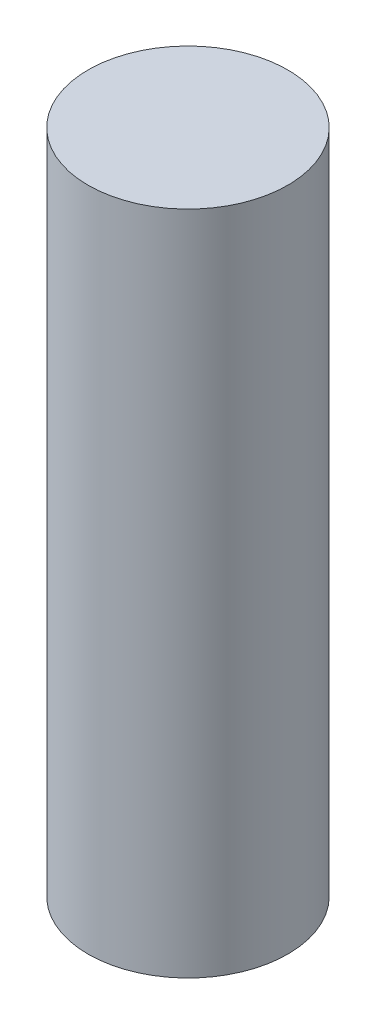
ISO-10303-21;
HEADER;
FILE_DESCRIPTION(('STEP AP214'),'2;1');
FILE_NAME('part.step','',(''),(''),'','','');
FILE_SCHEMA(('AUTOMOTIVE_DESIGN { 1 0 10303 214 1 1 1 1 }'));
ENDSEC;
DATA;
#1=APPLICATION_CONTEXT('core data for automotive mechanical design processes');
#2=APPLICATION_PROTOCOL_DEFINITION('international standard','automotive_design',2000,#1);
#3=PRODUCT_CONTEXT('',#1,'mechanical');
#4=PRODUCT('Part','Part','',(#3));
#5=PRODUCT_RELATED_PRODUCT_CATEGORY('part','',(#4));
#6=PRODUCT_DEFINITION_FORMATION('','',#4);
#7=PRODUCT_DEFINITION_CONTEXT('part definition',#1,'design');
#8=PRODUCT_DEFINITION('design','',#6,#7);
#9=PRODUCT_DEFINITION_SHAPE('','',#8);
#10=(LENGTH_UNIT() NAMED_UNIT(*) SI_UNIT(.MILLI.,.METRE.));
#11=(NAMED_UNIT(*) PLANE_ANGLE_UNIT() SI_UNIT($,.RADIAN.));
#12=(NAMED_UNIT(*) SI_UNIT($,.STERADIAN.) SOLID_ANGLE_UNIT());
#13=UNCERTAINTY_MEASURE_WITH_UNIT(LENGTH_MEASURE(1.E-05),#10,'distance_accuracy_value','');
#14=(GEOMETRIC_REPRESENTATION_CONTEXT(3) GLOBAL_UNCERTAINTY_ASSIGNED_CONTEXT((#13)) GLOBAL_UNIT_ASSIGNED_CONTEXT((#10,
#11,#12)) REPRESENTATION_CONTEXT('',''));
#15=CARTESIAN_POINT('',(0.,0.,0.));
#16=DIRECTION('',(0.,0.,1.));
#17=DIRECTION('',(1.,0.,0.));
#18=AXIS2_PLACEMENT_3D('',#15,#16,#17);
#19=CARTESIAN_POINT('',(0.,300.,0.));
#20=DIRECTION('',(0.,-1.,0.));
#21=DIRECTION('',(0.,0.,-1.));
#22=AXIS2_PLACEMENT_3D('',#19,#20,#21);
#23=CYLINDRICAL_SURFACE('',#22,45.);
#24=CARTESIAN_POINT('',(0.,300.,0.));
#25=DIRECTION('',(0.,1.,0.));
#26=DIRECTION('',(0.,0.,1.));
#27=AXIS2_PLACEMENT_3D('',#24,#25,#26);
#28=CIRCLE('',#27,45.);
#29=CARTESIAN_POINT('',(0.,300.,45.));
#30=VERTEX_POINT('',#29);
#31=EDGE_CURVE('E10',#30,#30,#28,.T.);
#32=ORIENTED_EDGE('',*,*,#31,.F.);
#33=EDGE_LOOP('',(#32));
#34=FACE_BOUND('',#33,.T.);
#35=CARTESIAN_POINT('',(0.,0.,0.));
#36=DIRECTION('',(0.,1.,0.));
#37=DIRECTION('',(0.,0.,1.));
#38=AXIS2_PLACEMENT_3D('',#35,#36,#37);
#39=CIRCLE('',#38,45.);
#40=CARTESIAN_POINT('',(0.,0.,45.));
#41=VERTEX_POINT('',#40);
#42=EDGE_CURVE('E36',#41,#41,#39,.T.);
#43=ORIENTED_EDGE('',*,*,#42,.T.);
#44=EDGE_LOOP('',(#43));
#45=FACE_BOUND('',#44,.T.);
#46=ADVANCED_FACE('F33',(#34,#45),#23,.T.);
#47=CARTESIAN_POINT('',(0.,300.,0.));
#48=DIRECTION('',(0.,1.,0.));
#49=DIRECTION('',(0.,0.,1.));
#50=AXIS2_PLACEMENT_3D('',#47,#48,#49);
#51=PLANE('',#50);
#52=ORIENTED_EDGE('',*,*,#31,.T.);
#53=EDGE_LOOP('',(#52));
#54=FACE_BOUND('',#53,.T.);
#55=ADVANCED_FACE('F48',(#54),#51,.T.);
#56=CARTESIAN_POINT('',(0.,0.,0.));
#57=DIRECTION('',(0.,1.,0.));
#58=DIRECTION('',(0.,0.,1.));
#59=AXIS2_PLACEMENT_3D('',#56,#57,#58);
#60=PLANE('',#59);
#61=ORIENTED_EDGE('',*,*,#42,.F.);
#62=EDGE_LOOP('',(#61));
#63=FACE_BOUND('',#62,.T.);
#64=ADVANCED_FACE('F46',(#63),#60,.F.);
#65=CLOSED_SHELL('',(#46,#55,#64));
#66=MANIFOLD_SOLID_BREP('B2',#65);
#67=ADVANCED_BREP_SHAPE_REPRESENTATION('',(#18,#66),#14);
#68=SHAPE_DEFINITION_REPRESENTATION(#9,#67);
ENDSEC;
END-ISO-10303-21;
